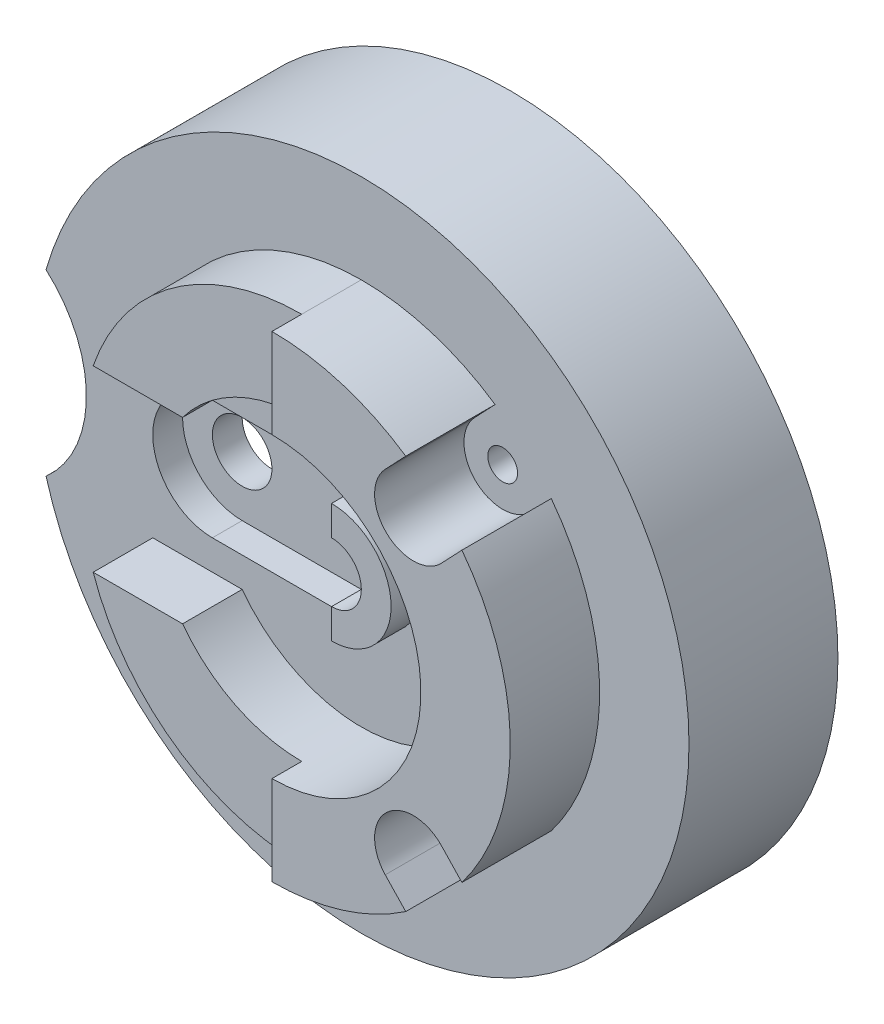
ISO-10303-21;
HEADER;
FILE_DESCRIPTION(('STEP AP214'),'2;1');
FILE_NAME('part.step','',(''),(''),'','','');
FILE_SCHEMA(('AUTOMOTIVE_DESIGN { 1 0 10303 214 1 1 1 1 }'));
ENDSEC;
DATA;
#1=APPLICATION_CONTEXT('core data for automotive mechanical design processes');
#2=APPLICATION_PROTOCOL_DEFINITION('international standard','automotive_design',2000,#1);
#3=PRODUCT_CONTEXT('',#1,'mechanical');
#4=PRODUCT('Part','Part','',(#3));
#5=PRODUCT_RELATED_PRODUCT_CATEGORY('part','',(#4));
#6=PRODUCT_DEFINITION_FORMATION('','',#4);
#7=PRODUCT_DEFINITION_CONTEXT('part definition',#1,'design');
#8=PRODUCT_DEFINITION('design','',#6,#7);
#9=PRODUCT_DEFINITION_SHAPE('','',#8);
#10=(LENGTH_UNIT() NAMED_UNIT(*) SI_UNIT(.MILLI.,.METRE.));
#11=(NAMED_UNIT(*) PLANE_ANGLE_UNIT() SI_UNIT($,.RADIAN.));
#12=(NAMED_UNIT(*) SI_UNIT($,.STERADIAN.) SOLID_ANGLE_UNIT());
#13=UNCERTAINTY_MEASURE_WITH_UNIT(LENGTH_MEASURE(1.E-05),#10,'distance_accuracy_value','');
#14=(GEOMETRIC_REPRESENTATION_CONTEXT(3) GLOBAL_UNCERTAINTY_ASSIGNED_CONTEXT((#13)) GLOBAL_UNIT_ASSIGNED_CONTEXT((#10,
#11,#12)) REPRESENTATION_CONTEXT('',''));
#15=CARTESIAN_POINT('',(0.,0.,0.));
#16=DIRECTION('',(0.,0.,1.));
#17=DIRECTION('',(1.,0.,0.));
#18=AXIS2_PLACEMENT_3D('',#15,#16,#17);
#19=CARTESIAN_POINT('',(-25.,0.,20.));
#20=DIRECTION('',(0.,0.,1.));
#21=DIRECTION('',(1.,0.,0.));
#22=AXIS2_PLACEMENT_3D('',#19,#20,#21);
#23=PLANE('',#22);
#24=CARTESIAN_POINT('',(-25.,0.,20.));
#25=DIRECTION('',(0.,0.,1.));
#26=DIRECTION('',(1.,0.,0.));
#27=AXIS2_PLACEMENT_3D('',#24,#25,#26);
#28=CIRCLE('',#27,5.);
#29=CARTESIAN_POINT('',(-20.,0.,20.));
#30=VERTEX_POINT('',#29);
#31=EDGE_CURVE('E255',#30,#30,#28,.T.);
#32=ORIENTED_EDGE('',*,*,#31,.F.);
#33=EDGE_LOOP('',(#32));
#34=FACE_BOUND('',#33,.T.);
#35=DIRECTION('',(1.,0.,0.));
#36=VECTOR('',#35,1.);
#37=CARTESIAN_POINT('',(-25.,-10.,20.));
#38=LINE('',#37,#36);
#39=CARTESIAN_POINT('',(-25.,-10.,20.));
#40=VERTEX_POINT('',#39);
#41=CARTESIAN_POINT('',(1.09408970951427E-13,-10.,20.));
#42=VERTEX_POINT('',#41);
#43=EDGE_CURVE('E264',#40,#42,#38,.T.);
#44=ORIENTED_EDGE('',*,*,#43,.T.);
#45=DIRECTION('',(0.,-1.,0.));
#46=VECTOR('',#45,1.);
#47=CARTESIAN_POINT('',(1.04744440165294E-13,-10.,20.));
#48=LINE('',#47,#46);
#49=CARTESIAN_POINT('',(0.,-4.99999999999998,20.));
#50=VERTEX_POINT('',#49);
#51=EDGE_CURVE('E823',#50,#42,#48,.T.);
#52=ORIENTED_EDGE('',*,*,#51,.F.);
#53=CARTESIAN_POINT('',(0.,0.,20.));
#54=DIRECTION('',(0.,0.,1.));
#55=DIRECTION('',(1.,0.,0.));
#56=AXIS2_PLACEMENT_3D('',#53,#54,#55);
#57=CIRCLE('',#56,5.);
#58=CARTESIAN_POINT('',(0.,5.00000000000002,20.));
#59=VERTEX_POINT('',#58);
#60=EDGE_CURVE('E245',#59,#50,#57,.T.);
#61=ORIENTED_EDGE('',*,*,#60,.F.);
#62=DIRECTION('',(0.,-1.,0.));
#63=VECTOR('',#62,1.);
#64=CARTESIAN_POINT('',(0.,5.00000000000002,20.));
#65=LINE('',#64,#63);
#66=CARTESIAN_POINT('',(0.,10.,20.));
#67=VERTEX_POINT('',#66);
#68=EDGE_CURVE('E241',#67,#59,#65,.T.);
#69=ORIENTED_EDGE('',*,*,#68,.F.);
#70=DIRECTION('',(-1.,0.,0.));
#71=VECTOR('',#70,1.);
#72=CARTESIAN_POINT('',(-25.,10.,20.));
#73=LINE('',#72,#71);
#74=CARTESIAN_POINT('',(-25.,10.,20.));
#75=VERTEX_POINT('',#74);
#76=EDGE_CURVE('E268',#67,#75,#73,.T.);
#77=ORIENTED_EDGE('',*,*,#76,.T.);
#78=CARTESIAN_POINT('',(-25.,0.,20.));
#79=DIRECTION('',(0.,0.,1.));
#80=DIRECTION('',(1.,0.,0.));
#81=AXIS2_PLACEMENT_3D('',#78,#79,#80);
#82=CIRCLE('',#81,10.);
#83=EDGE_CURVE('E261',#75,#40,#82,.T.);
#84=ORIENTED_EDGE('',*,*,#83,.T.);
#85=EDGE_LOOP('',(#44,#52,#61,#69,#77,#84));
#86=FACE_BOUND('',#85,.T.);
#87=ADVANCED_FACE('F37',(#34,#86),#23,.T.);
#88=CARTESIAN_POINT('',(0.,0.,40.));
#89=DIRECTION('',(0.,0.,-1.));
#90=DIRECTION('',(-1.,0.,0.));
#91=AXIS2_PLACEMENT_3D('',#88,#89,#90);
#92=CYLINDRICAL_SURFACE('',#91,40.);
#93=CARTESIAN_POINT('',(0.,0.,25.));
#94=DIRECTION('',(0.,0.,1.));
#95=DIRECTION('',(1.,0.,0.));
#96=AXIS2_PLACEMENT_3D('',#93,#94,#95);
#97=CIRCLE('',#96,40.);
#98=CARTESIAN_POINT('',(31.8856427380786,-24.1517243106908,25.));
#99=VERTEX_POINT('',#98);
#100=CARTESIAN_POINT('',(31.8856427380801,24.1517243106888,25.));
#101=VERTEX_POINT('',#100);
#102=EDGE_CURVE('E369',#99,#101,#97,.T.);
#103=ORIENTED_EDGE('',*,*,#102,.T.);
#104=DIRECTION('',(0.,0.,1.));
#105=VECTOR('',#104,1.);
#106=CARTESIAN_POINT('',(31.8856427380801,24.1517243106888,25.));
#107=LINE('',#106,#105);
#108=CARTESIAN_POINT('',(31.8856427380801,24.1517243106888,40.));
#109=VERTEX_POINT('',#108);
#110=EDGE_CURVE('E319',#101,#109,#107,.T.);
#111=ORIENTED_EDGE('',*,*,#110,.T.);
#112=CARTESIAN_POINT('',(0.,0.,40.));
#113=DIRECTION('',(0.,0.,1.));
#114=DIRECTION('',(1.,0.,0.));
#115=AXIS2_PLACEMENT_3D('',#112,#113,#114);
#116=CIRCLE('',#115,40.);
#117=CARTESIAN_POINT('',(31.8856427380786,-24.1517243106908,40.));
#118=VERTEX_POINT('',#117);
#119=EDGE_CURVE('E358',#118,#109,#116,.T.);
#120=ORIENTED_EDGE('',*,*,#119,.F.);
#121=DIRECTION('',(0.,0.,1.));
#122=VECTOR('',#121,1.);
#123=CARTESIAN_POINT('',(31.8856427380786,-24.1517243106908,25.));
#124=LINE('',#123,#122);
#125=EDGE_CURVE('E347',#99,#118,#124,.T.);
#126=ORIENTED_EDGE('',*,*,#125,.F.);
#127=EDGE_LOOP('',(#103,#111,#120,#126));
#128=FACE_BOUND('',#127,.T.);
#129=ADVANCED_FACE('F531',(#128),#92,.T.);
#130=CARTESIAN_POINT('',(22.4567005970187,33.1013081055094,40.));
#131=VERTEX_POINT('',#130);
#132=CARTESIAN_POINT('',(-1.29184809537196E-13,40.,40.));
#133=VERTEX_POINT('',#132);
#134=EDGE_CURVE('E359',#131,#133,#116,.T.);
#135=ORIENTED_EDGE('',*,*,#134,.F.);
#136=DIRECTION('',(0.,0.,1.));
#137=VECTOR('',#136,1.);
#138=CARTESIAN_POINT('',(22.4567005970186,33.1013081055094,25.));
#139=LINE('',#138,#137);
#140=CARTESIAN_POINT('',(22.4567005970186,33.1013081055094,25.));
#141=VERTEX_POINT('',#140);
#142=EDGE_CURVE('E311',#141,#131,#139,.T.);
#143=ORIENTED_EDGE('',*,*,#142,.F.);
#144=CARTESIAN_POINT('',(0.,40.,25.));
#145=VERTEX_POINT('',#144);
#146=EDGE_CURVE('E346',#141,#145,#97,.T.);
#147=ORIENTED_EDGE('',*,*,#146,.T.);
#148=DIRECTION('',(0.,0.,-1.));
#149=VECTOR('',#148,1.);
#150=CARTESIAN_POINT('',(0.,40.,35.));
#151=LINE('',#150,#149);
#152=CARTESIAN_POINT('',(0.,40.,35.));
#153=VERTEX_POINT('',#152);
#154=EDGE_CURVE('E419',#153,#145,#151,.T.);
#155=ORIENTED_EDGE('',*,*,#154,.F.);
#156=DIRECTION('',(0.,0.,-1.));
#157=VECTOR('',#156,1.);
#158=CARTESIAN_POINT('',(-1.29184809537196E-13,40.,40.));
#159=LINE('',#158,#157);
#160=EDGE_CURVE('E378',#133,#153,#159,.T.);
#161=ORIENTED_EDGE('',*,*,#160,.F.);
#162=EDGE_LOOP('',(#135,#143,#147,#155,#161));
#163=FACE_BOUND('',#162,.T.);
#164=ADVANCED_FACE('F496',(#163),#92,.T.);
#165=CARTESIAN_POINT('',(0.,0.,25.));
#166=DIRECTION('',(0.,0.,1.));
#167=DIRECTION('',(1.,0.,0.));
#168=AXIS2_PLACEMENT_3D('',#165,#166,#167);
#169=PLANE('',#168);
#170=CARTESIAN_POINT('',(-25.,0.,25.));
#171=DIRECTION('',(0.,0.,1.));
#172=DIRECTION('',(1.,0.,0.));
#173=AXIS2_PLACEMENT_3D('',#170,#171,#172);
#174=CIRCLE('',#173,10.);
#175=CARTESIAN_POINT('',(-25.,10.,25.));
#176=VERTEX_POINT('',#175);
#177=CARTESIAN_POINT('',(-25.,-10.,25.));
#178=VERTEX_POINT('',#177);
#179=EDGE_CURVE('E62',#176,#178,#174,.T.);
#180=ORIENTED_EDGE('',*,*,#179,.F.);
#181=DIRECTION('',(-1.,0.,0.));
#182=VECTOR('',#181,1.);
#183=CARTESIAN_POINT('',(-25.,10.,25.));
#184=LINE('',#183,#182);
#185=CARTESIAN_POINT('',(0.,10.,25.));
#186=VERTEX_POINT('',#185);
#187=EDGE_CURVE('E265',#186,#176,#184,.T.);
#188=ORIENTED_EDGE('',*,*,#187,.F.);
#189=CARTESIAN_POINT('',(0.,0.,25.));
#190=DIRECTION('',(0.,0.,1.));
#191=DIRECTION('',(1.,0.,0.));
#192=AXIS2_PLACEMENT_3D('',#189,#190,#191);
#193=CIRCLE('',#192,10.);
#194=CARTESIAN_POINT('',(1.09408970951427E-13,-10.,25.));
#195=VERTEX_POINT('',#194);
#196=EDGE_CURVE('E276',#195,#186,#193,.T.);
#197=ORIENTED_EDGE('',*,*,#196,.F.);
#198=DIRECTION('',(1.,0.,0.));
#199=VECTOR('',#198,1.);
#200=CARTESIAN_POINT('',(-25.,-10.,25.));
#201=LINE('',#200,#199);
#202=EDGE_CURVE('E273',#178,#195,#201,.T.);
#203=ORIENTED_EDGE('',*,*,#202,.F.);
#204=EDGE_LOOP('',(#180,#188,#197,#203));
#205=FACE_BOUND('',#204,.T.);
#206=CARTESIAN_POINT('',(15.,0.,25.));
#207=DIRECTION('',(0.,0.,1.));
#208=DIRECTION('',(1.,0.,0.));
#209=AXIS2_PLACEMENT_3D('',#206,#207,#208);
#210=CIRCLE('',#209,2.5);
#211=CARTESIAN_POINT('',(17.5,0.,25.));
#212=VERTEX_POINT('',#211);
#213=EDGE_CURVE('E282',#212,#212,#210,.T.);
#214=ORIENTED_EDGE('',*,*,#213,.F.);
#215=EDGE_LOOP('',(#214));
#216=FACE_BOUND('',#215,.T.);
#217=CARTESIAN_POINT('',(23.7290240541569,24.9999999999985,25.));
#218=DIRECTION('',(0.,0.,1.));
#219=DIRECTION('',(1.,0.,0.));
#220=AXIS2_PLACEMENT_3D('',#217,#218,#219);
#221=CIRCLE('',#220,2.5);
#222=CARTESIAN_POINT('',(26.2290240541569,24.9999999999985,25.));
#223=VERTEX_POINT('',#222);
#224=EDGE_CURVE('E292',#223,#223,#221,.T.);
#225=ORIENTED_EDGE('',*,*,#224,.F.);
#226=EDGE_LOOP('',(#225));
#227=FACE_BOUND('',#226,.T.);
#228=CARTESIAN_POINT('',(23.7290240541553,-25.,25.));
#229=DIRECTION('',(0.,0.,1.));
#230=DIRECTION('',(1.,0.,0.));
#231=AXIS2_PLACEMENT_3D('',#228,#229,#230);
#232=CIRCLE('',#231,2.5);
#233=CARTESIAN_POINT('',(26.2290240541553,-25.,25.));
#234=VERTEX_POINT('',#233);
#235=EDGE_CURVE('E297',#234,#234,#232,.T.);
#236=ORIENTED_EDGE('',*,*,#235,.F.);
#237=EDGE_LOOP('',(#236));
#238=FACE_BOUND('',#237,.T.);
#239=CARTESIAN_POINT('',(-66.1437827766147,0.,25.));
#240=DIRECTION('',(0.,0.,1.));
#241=DIRECTION('',(-1.,0.,0.));
#242=AXIS2_PLACEMENT_3D('',#239,#240,#241);
#243=CIRCLE('',#242,20.);
#244=CARTESIAN_POINT('',(-52.9150262212918,-15.,25.));
#245=VERTEX_POINT('',#244);
#246=CARTESIAN_POINT('',(-52.9150262212918,15.,25.));
#247=VERTEX_POINT('',#246);
#248=EDGE_CURVE('E432',#245,#247,#243,.T.);
#249=ORIENTED_EDGE('',*,*,#248,.F.);
#250=CARTESIAN_POINT('',(0.,0.,25.));
#251=DIRECTION('',(0.,0.,1.));
#252=DIRECTION('',(1.,0.,0.));
#253=AXIS2_PLACEMENT_3D('',#250,#251,#252);
#254=CIRCLE('',#253,55.);
#255=EDGE_CURVE('E458',#245,#247,#254,.T.);
#256=ORIENTED_EDGE('',*,*,#255,.T.);
#257=EDGE_LOOP('',(#249,#256));
#258=FACE_BOUND('',#257,.T.);
#259=CARTESIAN_POINT('',(0.,3.,25.));
#260=DIRECTION('',(0.,0.,1.));
#261=DIRECTION('',(-1.,0.,0.));
#262=AXIS2_PLACEMENT_3D('',#259,#260,#261);
#263=CIRCLE('',#262,37.);
#264=CARTESIAN_POINT('',(-35.,15.,25.));
#265=VERTEX_POINT('',#264);
#266=EDGE_CURVE('E408',#145,#265,#263,.T.);
#267=ORIENTED_EDGE('',*,*,#266,.F.);
#268=ORIENTED_EDGE('',*,*,#146,.F.);
#269=DIRECTION('',(-0.688429522678506,-0.725303241620113,0.));
#270=VECTOR('',#269,1.);
#271=CARTESIAN_POINT('',(22.4567005970186,33.1013081055094,25.));
#272=LINE('',#271,#270);
#273=CARTESIAN_POINT('',(19.0145529836261,29.4747918974088,25.));
#274=VERTEX_POINT('',#273);
#275=EDGE_CURVE('E301',#141,#274,#272,.T.);
#276=ORIENTED_EDGE('',*,*,#275,.T.);
#277=CARTESIAN_POINT('',(23.7290240541569,24.9999999999985,25.));
#278=DIRECTION('',(0.,0.,1.));
#279=DIRECTION('',(-1.,0.,0.));
#280=AXIS2_PLACEMENT_3D('',#277,#278,#279);
#281=CIRCLE('',#280,6.5);
#282=CARTESIAN_POINT('',(28.4434951246876,20.5252081025882,25.));
#283=VERTEX_POINT('',#282);
#284=EDGE_CURVE('E304',#274,#283,#281,.T.);
#285=ORIENTED_EDGE('',*,*,#284,.T.);
#286=DIRECTION('',(0.688429522678506,0.725303241620114,0.));
#287=VECTOR('',#286,1.);
#288=CARTESIAN_POINT('',(31.8856427380801,24.1517243106888,25.));
#289=LINE('',#288,#287);
#290=EDGE_CURVE('E308',#283,#101,#289,.T.);
#291=ORIENTED_EDGE('',*,*,#290,.T.);
#292=ORIENTED_EDGE('',*,*,#102,.F.);
#293=DIRECTION('',(-0.688429522678461,0.725303241620156,0.));
#294=VECTOR('',#293,1.);
#295=CARTESIAN_POINT('',(28.4434951246863,-20.52520810259,25.));
#296=LINE('',#295,#294);
#297=CARTESIAN_POINT('',(28.4434951246863,-20.52520810259,25.));
#298=VERTEX_POINT('',#297);
#299=EDGE_CURVE('E335',#99,#298,#296,.T.);
#300=ORIENTED_EDGE('',*,*,#299,.T.);
#301=CARTESIAN_POINT('',(23.7290240541553,-25.,25.));
#302=DIRECTION('',(0.,0.,1.));
#303=DIRECTION('',(-1.,0.,0.));
#304=AXIS2_PLACEMENT_3D('',#301,#302,#303);
#305=CIRCLE('',#304,6.5);
#306=CARTESIAN_POINT('',(19.0145529836242,-29.47479189741,25.));
#307=VERTEX_POINT('',#306);
#308=EDGE_CURVE('E328',#298,#307,#305,.T.);
#309=ORIENTED_EDGE('',*,*,#308,.T.);
#310=DIRECTION('',(0.688429522678461,-0.725303241620155,0.));
#311=VECTOR('',#310,1.);
#312=CARTESIAN_POINT('',(19.0145529836242,-29.47479189741,25.));
#313=LINE('',#312,#311);
#314=CARTESIAN_POINT('',(22.4567005970166,-33.1013081055108,25.));
#315=VERTEX_POINT('',#314);
#316=EDGE_CURVE('E331',#307,#315,#313,.T.);
#317=ORIENTED_EDGE('',*,*,#316,.T.);
#318=CARTESIAN_POINT('',(0.,-40.,25.));
#319=VERTEX_POINT('',#318);
#320=EDGE_CURVE('E366',#319,#315,#97,.T.);
#321=ORIENTED_EDGE('',*,*,#320,.F.);
#322=CARTESIAN_POINT('',(0.,-2.99999999999996,25.));
#323=DIRECTION('',(0.,0.,1.));
#324=DIRECTION('',(1.,0.,0.));
#325=AXIS2_PLACEMENT_3D('',#322,#323,#324);
#326=CIRCLE('',#325,37.);
#327=CARTESIAN_POINT('',(-35.,-15.,25.));
#328=VERTEX_POINT('',#327);
#329=EDGE_CURVE('E386',#328,#319,#326,.T.);
#330=ORIENTED_EDGE('',*,*,#329,.F.);
#331=DIRECTION('',(1.,0.,0.));
#332=VECTOR('',#331,1.);
#333=CARTESIAN_POINT('',(0.,-15.,25.));
#334=LINE('',#333,#332);
#335=CARTESIAN_POINT('',(-20.,-15.,25.));
#336=VERTEX_POINT('',#335);
#337=EDGE_CURVE('E381',#328,#336,#334,.T.);
#338=ORIENTED_EDGE('',*,*,#337,.T.);
#339=CARTESIAN_POINT('',(0.,0.,25.));
#340=DIRECTION('',(0.,0.,-1.));
#341=DIRECTION('',(-1.,0.,0.));
#342=AXIS2_PLACEMENT_3D('',#339,#340,#341);
#343=CIRCLE('',#342,25.);
#344=CARTESIAN_POINT('',(-20.,15.,25.));
#345=VERTEX_POINT('',#344);
#346=EDGE_CURVE('E413',#345,#336,#343,.T.);
#347=ORIENTED_EDGE('',*,*,#346,.F.);
#348=DIRECTION('',(1.,0.,0.));
#349=VECTOR('',#348,1.);
#350=CARTESIAN_POINT('',(-35.,15.,25.));
#351=LINE('',#350,#349);
#352=EDGE_CURVE('E422',#265,#345,#351,.T.);
#353=ORIENTED_EDGE('',*,*,#352,.F.);
#354=EDGE_LOOP('',(#267,#268,#276,#285,#291,#292,#300,#309,#317,#321,#330,#338,#347,#353));
#355=FACE_BOUND('',#354,.T.);
#356=ADVANCED_FACE('F493',(#205,#216,#227,#238,#258,#355),#169,.T.);
#357=CARTESIAN_POINT('',(0.,0.,25.));
#358=DIRECTION('',(0.,0.,-1.));
#359=DIRECTION('',(-1.,0.,0.));
#360=AXIS2_PLACEMENT_3D('',#357,#358,#359);
#361=CYLINDRICAL_SURFACE('',#360,55.);
#362=CARTESIAN_POINT('',(1.94289029309402E-13,0.,10.));
#363=DIRECTION('',(0.,0.,1.));
#364=DIRECTION('',(-1.,0.,0.));
#365=AXIS2_PLACEMENT_3D('',#362,#363,#364);
#366=CIRCLE('',#365,55.0000000000002);
#367=CARTESIAN_POINT('',(-52.9150262212918,15.,10.));
#368=VERTEX_POINT('',#367);
#369=CARTESIAN_POINT('',(-52.9150262212918,-15.,10.));
#370=VERTEX_POINT('',#369);
#371=EDGE_CURVE('E433',#368,#370,#366,.T.);
#372=ORIENTED_EDGE('',*,*,#371,.F.);
#373=DIRECTION('',(0.,0.,1.));
#374=VECTOR('',#373,1.);
#375=CARTESIAN_POINT('',(-52.9150262212918,15.,10.));
#376=LINE('',#375,#374);
#377=EDGE_CURVE('E441',#368,#247,#376,.T.);
#378=ORIENTED_EDGE('',*,*,#377,.T.);
#379=ORIENTED_EDGE('',*,*,#255,.F.);
#380=DIRECTION('',(0.,0.,1.));
#381=VECTOR('',#380,1.);
#382=CARTESIAN_POINT('',(-52.9150262212918,-15.,10.));
#383=LINE('',#382,#381);
#384=EDGE_CURVE('E439',#370,#245,#383,.T.);
#385=ORIENTED_EDGE('',*,*,#384,.F.);
#386=EDGE_LOOP('',(#372,#378,#379,#385));
#387=FACE_BOUND('',#386,.T.);
#388=CARTESIAN_POINT('',(0.,0.,0.));
#389=DIRECTION('',(0.,0.,1.));
#390=DIRECTION('',(1.,0.,0.));
#391=AXIS2_PLACEMENT_3D('',#388,#389,#390);
#392=CIRCLE('',#391,55.);
#393=CARTESIAN_POINT('',(55.,0.,0.));
#394=VERTEX_POINT('',#393);
#395=EDGE_CURVE('E455',#394,#394,#392,.T.);
#396=ORIENTED_EDGE('',*,*,#395,.T.);
#397=EDGE_LOOP('',(#396));
#398=FACE_BOUND('',#397,.T.);
#399=ADVANCED_FACE('F39',(#387,#398),#361,.T.);
#400=CARTESIAN_POINT('',(0.,0.,0.));
#401=DIRECTION('',(0.,0.,1.));
#402=DIRECTION('',(1.,0.,0.));
#403=AXIS2_PLACEMENT_3D('',#400,#401,#402);
#404=PLANE('',#403);
#405=CARTESIAN_POINT('',(0.,0.,0.));
#406=DIRECTION('',(0.,0.,-1.));
#407=DIRECTION('',(-1.,0.,0.));
#408=AXIS2_PLACEMENT_3D('',#405,#406,#407);
#409=CIRCLE('',#408,50.);
#410=CARTESIAN_POINT('',(-50.,0.,0.));
#411=VERTEX_POINT('',#410);
#412=EDGE_CURVE('E451',#411,#411,#409,.T.);
#413=ORIENTED_EDGE('',*,*,#412,.F.);
#414=EDGE_LOOP('',(#413));
#415=FACE_BOUND('',#414,.T.);
#416=ORIENTED_EDGE('',*,*,#395,.F.);
#417=EDGE_LOOP('',(#416));
#418=FACE_BOUND('',#417,.T.);
#419=ADVANCED_FACE('F641',(#415,#418),#404,.F.);
#420=CARTESIAN_POINT('',(0.,0.,15.));
#421=DIRECTION('',(0.,0.,-1.));
#422=DIRECTION('',(-1.,0.,0.));
#423=AXIS2_PLACEMENT_3D('',#420,#421,#422);
#424=CYLINDRICAL_SURFACE('',#423,50.);
#425=CARTESIAN_POINT('',(0.,0.,15.));
#426=DIRECTION('',(0.,0.,-1.));
#427=DIRECTION('',(-1.,0.,0.));
#428=AXIS2_PLACEMENT_3D('',#425,#426,#427);
#429=CIRCLE('',#428,50.);
#430=CARTESIAN_POINT('',(-48.9463992546949,10.2102889283311,15.));
#431=VERTEX_POINT('',#430);
#432=CARTESIAN_POINT('',(-48.9463992546949,-10.2102889283311,15.));
#433=VERTEX_POINT('',#432);
#434=EDGE_CURVE('E452',#431,#433,#429,.T.);
#435=ORIENTED_EDGE('',*,*,#434,.F.);
#436=DIRECTION('',(0.,0.,1.));
#437=VECTOR('',#436,1.);
#438=CARTESIAN_POINT('',(-48.9463992546949,10.2102889283311,17.5));
#439=LINE('',#438,#437);
#440=CARTESIAN_POINT('',(-48.9463992546949,10.2102889283311,10.));
#441=VERTEX_POINT('',#440);
#442=EDGE_CURVE('E448',#431,#441,#439,.F.);
#443=ORIENTED_EDGE('',*,*,#442,.T.);
#444=CARTESIAN_POINT('',(0.,0.,10.));
#445=DIRECTION('',(0.,0.,-1.));
#446=DIRECTION('',(-1.,0.,0.));
#447=AXIS2_PLACEMENT_3D('',#444,#445,#446);
#448=CIRCLE('',#447,50.);
#449=CARTESIAN_POINT('',(-48.9463992546949,-10.2102889283311,10.));
#450=VERTEX_POINT('',#449);
#451=EDGE_CURVE('E11',#441,#450,#448,.F.);
#452=ORIENTED_EDGE('',*,*,#451,.T.);
#453=DIRECTION('',(0.,0.,1.));
#454=VECTOR('',#453,1.);
#455=CARTESIAN_POINT('',(-48.9463992546949,-10.2102889283311,17.5));
#456=LINE('',#455,#454);
#457=EDGE_CURVE('E444',#450,#433,#456,.T.);
#458=ORIENTED_EDGE('',*,*,#457,.T.);
#459=EDGE_LOOP('',(#435,#443,#452,#458));
#460=FACE_BOUND('',#459,.T.);
#461=ORIENTED_EDGE('',*,*,#412,.T.);
#462=EDGE_LOOP('',(#461));
#463=FACE_BOUND('',#462,.T.);
#464=ADVANCED_FACE('F473',(#460,#463),#424,.F.);
#465=CARTESIAN_POINT('',(0.,0.,15.));
#466=DIRECTION('',(0.,0.,-1.));
#467=DIRECTION('',(-1.,0.,0.));
#468=AXIS2_PLACEMENT_3D('',#465,#466,#467);
#469=PLANE('',#468);
#470=CARTESIAN_POINT('',(0.,0.,15.));
#471=DIRECTION('',(0.,0.,-1.));
#472=DIRECTION('',(-1.,0.,0.));
#473=AXIS2_PLACEMENT_3D('',#470,#471,#472);
#474=CIRCLE('',#473,5.);
#475=CARTESIAN_POINT('',(-5.,0.,15.));
#476=VERTEX_POINT('',#475);
#477=EDGE_CURVE('E247',#476,#476,#474,.T.);
#478=ORIENTED_EDGE('',*,*,#477,.F.);
#479=EDGE_LOOP('',(#478));
#480=FACE_BOUND('',#479,.T.);
#481=CARTESIAN_POINT('',(-25.,0.,15.));
#482=DIRECTION('',(0.,0.,-1.));
#483=DIRECTION('',(-1.,0.,0.));
#484=AXIS2_PLACEMENT_3D('',#481,#482,#483);
#485=CIRCLE('',#484,5.);
#486=CARTESIAN_POINT('',(-30.,0.,15.));
#487=VERTEX_POINT('',#486);
#488=EDGE_CURVE('E258',#487,#487,#485,.T.);
#489=ORIENTED_EDGE('',*,*,#488,.F.);
#490=EDGE_LOOP('',(#489));
#491=FACE_BOUND('',#490,.T.);
#492=CARTESIAN_POINT('',(15.,0.,15.));
#493=DIRECTION('',(0.,0.,1.));
#494=DIRECTION('',(1.,0.,0.));
#495=AXIS2_PLACEMENT_3D('',#492,#493,#494);
#496=CIRCLE('',#495,2.5);
#497=CARTESIAN_POINT('',(17.5,0.,15.));
#498=VERTEX_POINT('',#497);
#499=EDGE_CURVE('E289',#498,#498,#496,.T.);
#500=ORIENTED_EDGE('',*,*,#499,.T.);
#501=EDGE_LOOP('',(#500));
#502=FACE_BOUND('',#501,.T.);
#503=CARTESIAN_POINT('',(23.7290240541569,24.9999999999985,15.));
#504=DIRECTION('',(0.,0.,-1.));
#505=DIRECTION('',(-1.,0.,0.));
#506=AXIS2_PLACEMENT_3D('',#503,#504,#505);
#507=CIRCLE('',#506,2.5);
#508=CARTESIAN_POINT('',(21.2290240541569,24.9999999999985,15.));
#509=VERTEX_POINT('',#508);
#510=EDGE_CURVE('E41',#509,#509,#507,.T.);
#511=ORIENTED_EDGE('',*,*,#510,.F.);
#512=EDGE_LOOP('',(#511));
#513=FACE_BOUND('',#512,.T.);
#514=CARTESIAN_POINT('',(23.7290240541553,-25.,15.));
#515=DIRECTION('',(0.,0.,-1.));
#516=DIRECTION('',(-1.,0.,0.));
#517=AXIS2_PLACEMENT_3D('',#514,#515,#516);
#518=CIRCLE('',#517,2.5);
#519=CARTESIAN_POINT('',(21.2290240541553,-25.,15.));
#520=VERTEX_POINT('',#519);
#521=EDGE_CURVE('E300',#520,#520,#518,.T.);
#522=ORIENTED_EDGE('',*,*,#521,.F.);
#523=EDGE_LOOP('',(#522));
#524=FACE_BOUND('',#523,.T.);
#525=CARTESIAN_POINT('',(-66.1437827766147,0.,15.));
#526=DIRECTION('',(0.,0.,-1.));
#527=DIRECTION('',(-1.,0.,0.));
#528=AXIS2_PLACEMENT_3D('',#525,#526,#527);
#529=CIRCLE('',#528,20.);
#530=EDGE_CURVE('E46',#431,#433,#529,.T.);
#531=ORIENTED_EDGE('',*,*,#530,.F.);
#532=ORIENTED_EDGE('',*,*,#434,.T.);
#533=EDGE_LOOP('',(#531,#532));
#534=FACE_BOUND('',#533,.T.);
#535=ADVANCED_FACE('F469',(#480,#491,#502,#513,#524,#534),#469,.T.);
#536=CARTESIAN_POINT('',(-33.0718913883073,0.,10.));
#537=DIRECTION('',(0.,0.,-1.));
#538=DIRECTION('',(-1.,0.,0.));
#539=AXIS2_PLACEMENT_3D('',#536,#537,#538);
#540=PLANE('',#539);
#541=CARTESIAN_POINT('',(-66.1437827766147,0.,10.));
#542=DIRECTION('',(0.,0.,1.));
#543=DIRECTION('',(-1.,0.,0.));
#544=AXIS2_PLACEMENT_3D('',#541,#542,#543);
#545=CIRCLE('',#544,20.);
#546=EDGE_CURVE('E435',#441,#368,#545,.T.);
#547=ORIENTED_EDGE('',*,*,#546,.T.);
#548=ORIENTED_EDGE('',*,*,#371,.T.);
#549=EDGE_CURVE('E436',#370,#450,#545,.T.);
#550=ORIENTED_EDGE('',*,*,#549,.T.);
#551=ORIENTED_EDGE('',*,*,#451,.F.);
#552=EDGE_LOOP('',(#547,#548,#550,#551));
#553=FACE_BOUND('',#552,.T.);
#554=ADVANCED_FACE('F472',(#553),#540,.F.);
#555=CARTESIAN_POINT('',(-66.1437827766147,0.,10.));
#556=DIRECTION('',(0.,0.,1.));
#557=DIRECTION('',(1.,0.,0.));
#558=AXIS2_PLACEMENT_3D('',#555,#556,#557);
#559=CYLINDRICAL_SURFACE('',#558,20.);
#560=ORIENTED_EDGE('',*,*,#530,.T.);
#561=ORIENTED_EDGE('',*,*,#457,.F.);
#562=ORIENTED_EDGE('',*,*,#549,.F.);
#563=ORIENTED_EDGE('',*,*,#384,.T.);
#564=ORIENTED_EDGE('',*,*,#248,.T.);
#565=ORIENTED_EDGE('',*,*,#377,.F.);
#566=ORIENTED_EDGE('',*,*,#546,.F.);
#567=ORIENTED_EDGE('',*,*,#442,.F.);
#568=EDGE_LOOP('',(#560,#561,#562,#563,#564,#565,#566,#567));
#569=FACE_BOUND('',#568,.T.);
#570=ADVANCED_FACE('F482',(#569),#559,.F.);
#571=CARTESIAN_POINT('',(0.,3.,35.));
#572=DIRECTION('',(0.,0.,-1.));
#573=DIRECTION('',(-1.,0.,0.));
#574=AXIS2_PLACEMENT_3D('',#571,#572,#573);
#575=CYLINDRICAL_SURFACE('',#574,37.);
#576=ORIENTED_EDGE('',*,*,#266,.T.);
#577=DIRECTION('',(0.,0.,-1.));
#578=VECTOR('',#577,1.);
#579=CARTESIAN_POINT('',(-35.,15.,35.));
#580=LINE('',#579,#578);
#581=CARTESIAN_POINT('',(-35.,15.,35.));
#582=VERTEX_POINT('',#581);
#583=EDGE_CURVE('E430',#582,#265,#580,.T.);
#584=ORIENTED_EDGE('',*,*,#583,.F.);
#585=CARTESIAN_POINT('',(0.,3.,35.));
#586=DIRECTION('',(0.,0.,1.));
#587=DIRECTION('',(-1.,0.,0.));
#588=AXIS2_PLACEMENT_3D('',#585,#586,#587);
#589=CIRCLE('',#588,37.);
#590=EDGE_CURVE('E409',#153,#582,#589,.T.);
#591=ORIENTED_EDGE('',*,*,#590,.F.);
#592=ORIENTED_EDGE('',*,*,#154,.T.);
#593=EDGE_LOOP('',(#576,#584,#591,#592));
#594=FACE_BOUND('',#593,.T.);
#595=ADVANCED_FACE('F505',(#594),#575,.T.);
#596=CARTESIAN_POINT('',(-35.,15.,35.));
#597=DIRECTION('',(0.,1.,0.));
#598=DIRECTION('',(0.,0.,1.));
#599=AXIS2_PLACEMENT_3D('',#596,#597,#598);
#600=PLANE('',#599);
#601=ORIENTED_EDGE('',*,*,#352,.T.);
#602=DIRECTION('',(0.,0.,-1.));
#603=VECTOR('',#602,1.);
#604=CARTESIAN_POINT('',(-20.,15.,35.));
#605=LINE('',#604,#603);
#606=CARTESIAN_POINT('',(-20.,15.,35.));
#607=VERTEX_POINT('',#606);
#608=EDGE_CURVE('E427',#607,#345,#605,.T.);
#609=ORIENTED_EDGE('',*,*,#608,.F.);
#610=DIRECTION('',(1.,0.,0.));
#611=VECTOR('',#610,1.);
#612=CARTESIAN_POINT('',(-35.,15.,35.));
#613=LINE('',#612,#611);
#614=EDGE_CURVE('E412',#582,#607,#613,.T.);
#615=ORIENTED_EDGE('',*,*,#614,.F.);
#616=ORIENTED_EDGE('',*,*,#583,.T.);
#617=EDGE_LOOP('',(#601,#609,#615,#616));
#618=FACE_BOUND('',#617,.T.);
#619=ADVANCED_FACE('F629',(#618),#600,.F.);
#620=CARTESIAN_POINT('',(0.,0.,35.));
#621=DIRECTION('',(0.,0.,-1.));
#622=DIRECTION('',(-1.,0.,0.));
#623=AXIS2_PLACEMENT_3D('',#620,#621,#622);
#624=CYLINDRICAL_SURFACE('',#623,25.);
#625=ORIENTED_EDGE('',*,*,#346,.T.);
#626=DIRECTION('',(0.,0.,-1.));
#627=VECTOR('',#626,1.);
#628=CARTESIAN_POINT('',(-20.,-15.,35.));
#629=LINE('',#628,#627);
#630=CARTESIAN_POINT('',(-20.,-15.,35.));
#631=VERTEX_POINT('',#630);
#632=EDGE_CURVE('E395',#631,#336,#629,.T.);
#633=ORIENTED_EDGE('',*,*,#632,.F.);
#634=CARTESIAN_POINT('',(0.,0.,35.));
#635=DIRECTION('',(0.,0.,1.));
#636=DIRECTION('',(1.,0.,0.));
#637=AXIS2_PLACEMENT_3D('',#634,#635,#636);
#638=CIRCLE('',#637,25.);
#639=CARTESIAN_POINT('',(0.,-25.,35.));
#640=VERTEX_POINT('',#639);
#641=EDGE_CURVE('E392',#631,#640,#638,.T.);
#642=ORIENTED_EDGE('',*,*,#641,.T.);
#643=DIRECTION('',(0.,0.,-1.));
#644=VECTOR('',#643,1.);
#645=CARTESIAN_POINT('',(0.,-25.,40.));
#646=LINE('',#645,#644);
#647=CARTESIAN_POINT('',(0.,-25.,40.));
#648=VERTEX_POINT('',#647);
#649=EDGE_CURVE('E372',#648,#640,#646,.T.);
#650=ORIENTED_EDGE('',*,*,#649,.F.);
#651=CARTESIAN_POINT('',(0.,0.,40.));
#652=DIRECTION('',(0.,0.,-1.));
#653=DIRECTION('',(1.,0.,0.));
#654=AXIS2_PLACEMENT_3D('',#651,#652,#653);
#655=CIRCLE('',#654,25.);
#656=CARTESIAN_POINT('',(0.,25.,40.));
#657=VERTEX_POINT('',#656);
#658=EDGE_CURVE('E361',#657,#648,#655,.T.);
#659=ORIENTED_EDGE('',*,*,#658,.F.);
#660=DIRECTION('',(0.,0.,-1.));
#661=VECTOR('',#660,1.);
#662=CARTESIAN_POINT('',(0.,25.,40.));
#663=LINE('',#662,#661);
#664=CARTESIAN_POINT('',(0.,25.,35.));
#665=VERTEX_POINT('',#664);
#666=EDGE_CURVE('E375',#657,#665,#663,.T.);
#667=ORIENTED_EDGE('',*,*,#666,.T.);
#668=CARTESIAN_POINT('',(0.,0.,35.));
#669=DIRECTION('',(0.,0.,-1.));
#670=DIRECTION('',(-1.,0.,0.));
#671=AXIS2_PLACEMENT_3D('',#668,#669,#670);
#672=CIRCLE('',#671,25.);
#673=EDGE_CURVE('E415',#607,#665,#672,.T.);
#674=ORIENTED_EDGE('',*,*,#673,.F.);
#675=ORIENTED_EDGE('',*,*,#608,.T.);
#676=EDGE_LOOP('',(#625,#633,#642,#650,#659,#667,#674,#675));
#677=FACE_BOUND('',#676,.T.);
#678=ADVANCED_FACE('F625',(#677),#624,.F.);
#679=CARTESIAN_POINT('',(0.,3.,35.));
#680=DIRECTION('',(0.,0.,-1.));
#681=DIRECTION('',(-1.,0.,0.));
#682=AXIS2_PLACEMENT_3D('',#679,#680,#681);
#683=PLANE('',#682);
#684=ORIENTED_EDGE('',*,*,#590,.T.);
#685=ORIENTED_EDGE('',*,*,#614,.T.);
#686=ORIENTED_EDGE('',*,*,#673,.T.);
#687=DIRECTION('',(0.,1.,0.));
#688=VECTOR('',#687,1.);
#689=CARTESIAN_POINT('',(0.,40.,35.));
#690=LINE('',#689,#688);
#691=EDGE_CURVE('E417',#665,#153,#690,.T.);
#692=ORIENTED_EDGE('',*,*,#691,.T.);
#693=EDGE_LOOP('',(#684,#685,#686,#692));
#694=FACE_BOUND('',#693,.T.);
#695=ADVANCED_FACE('F621',(#694),#683,.F.);
#696=CARTESIAN_POINT('',(0.,-15.,35.));
#697=DIRECTION('',(0.,1.,0.));
#698=DIRECTION('',(-1.,0.,0.));
#699=AXIS2_PLACEMENT_3D('',#696,#697,#698);
#700=PLANE('',#699);
#701=ORIENTED_EDGE('',*,*,#337,.F.);
#702=DIRECTION('',(0.,0.,-1.));
#703=VECTOR('',#702,1.);
#704=CARTESIAN_POINT('',(-35.,-15.,35.));
#705=LINE('',#704,#703);
#706=CARTESIAN_POINT('',(-35.,-15.,35.));
#707=VERTEX_POINT('',#706);
#708=EDGE_CURVE('E405',#707,#328,#705,.T.);
#709=ORIENTED_EDGE('',*,*,#708,.F.);
#710=DIRECTION('',(1.,0.,0.));
#711=VECTOR('',#710,1.);
#712=CARTESIAN_POINT('',(0.,-15.,35.));
#713=LINE('',#712,#711);
#714=EDGE_CURVE('E382',#707,#631,#713,.T.);
#715=ORIENTED_EDGE('',*,*,#714,.T.);
#716=ORIENTED_EDGE('',*,*,#632,.T.);
#717=EDGE_LOOP('',(#701,#709,#715,#716));
#718=FACE_BOUND('',#717,.T.);
#719=ADVANCED_FACE('F617',(#718),#700,.T.);
#720=CARTESIAN_POINT('',(0.,-2.99999999999996,35.));
#721=DIRECTION('',(0.,0.,-1.));
#722=DIRECTION('',(-1.,0.,0.));
#723=AXIS2_PLACEMENT_3D('',#720,#721,#722);
#724=CYLINDRICAL_SURFACE('',#723,37.);
#725=ORIENTED_EDGE('',*,*,#329,.T.);
#726=DIRECTION('',(0.,0.,-1.));
#727=VECTOR('',#726,1.);
#728=CARTESIAN_POINT('',(0.,-40.,35.));
#729=LINE('',#728,#727);
#730=CARTESIAN_POINT('',(0.,-40.,35.));
#731=VERTEX_POINT('',#730);
#732=EDGE_CURVE('E402',#731,#319,#729,.T.);
#733=ORIENTED_EDGE('',*,*,#732,.F.);
#734=CARTESIAN_POINT('',(0.,-2.99999999999996,35.));
#735=DIRECTION('',(0.,0.,1.));
#736=DIRECTION('',(1.,0.,0.));
#737=AXIS2_PLACEMENT_3D('',#734,#735,#736);
#738=CIRCLE('',#737,37.);
#739=EDGE_CURVE('E385',#707,#731,#738,.T.);
#740=ORIENTED_EDGE('',*,*,#739,.F.);
#741=ORIENTED_EDGE('',*,*,#708,.T.);
#742=EDGE_LOOP('',(#725,#733,#740,#741));
#743=FACE_BOUND('',#742,.T.);
#744=ADVANCED_FACE('F613',(#743),#724,.T.);
#745=CARTESIAN_POINT('',(0.,0.,35.));
#746=DIRECTION('',(0.,0.,1.));
#747=DIRECTION('',(1.,0.,0.));
#748=AXIS2_PLACEMENT_3D('',#745,#746,#747);
#749=PLANE('',#748);
#750=ORIENTED_EDGE('',*,*,#714,.F.);
#751=ORIENTED_EDGE('',*,*,#739,.T.);
#752=DIRECTION('',(0.,-1.,0.));
#753=VECTOR('',#752,1.);
#754=CARTESIAN_POINT('',(0.,0.,35.));
#755=LINE('',#754,#753);
#756=EDGE_CURVE('E389',#640,#731,#755,.T.);
#757=ORIENTED_EDGE('',*,*,#756,.F.);
#758=ORIENTED_EDGE('',*,*,#641,.F.);
#759=EDGE_LOOP('',(#750,#751,#757,#758));
#760=FACE_BOUND('',#759,.T.);
#761=ADVANCED_FACE('F607',(#760),#749,.T.);
#762=CARTESIAN_POINT('',(0.,25.,40.));
#763=DIRECTION('',(1.,0.,0.));
#764=DIRECTION('',(0.,1.,0.));
#765=AXIS2_PLACEMENT_3D('',#762,#763,#764);
#766=PLANE('',#765);
#767=ORIENTED_EDGE('',*,*,#160,.T.);
#768=ORIENTED_EDGE('',*,*,#691,.F.);
#769=ORIENTED_EDGE('',*,*,#666,.F.);
#770=DIRECTION('',(0.,-1.,0.));
#771=VECTOR('',#770,1.);
#772=CARTESIAN_POINT('',(0.,25.,40.));
#773=LINE('',#772,#771);
#774=EDGE_CURVE('E357',#133,#657,#773,.T.);
#775=ORIENTED_EDGE('',*,*,#774,.F.);
#776=EDGE_LOOP('',(#767,#768,#769,#775));
#777=FACE_BOUND('',#776,.T.);
#778=ADVANCED_FACE('F515',(#777),#766,.F.);
#779=ORIENTED_EDGE('',*,*,#320,.T.);
#780=DIRECTION('',(0.,0.,1.));
#781=VECTOR('',#780,1.);
#782=CARTESIAN_POINT('',(22.4567005970166,-33.1013081055108,25.));
#783=LINE('',#782,#781);
#784=CARTESIAN_POINT('',(22.4567005970166,-33.1013081055108,40.));
#785=VERTEX_POINT('',#784);
#786=EDGE_CURVE('E349',#315,#785,#783,.T.);
#787=ORIENTED_EDGE('',*,*,#786,.T.);
#788=CARTESIAN_POINT('',(0.,-40.,40.));
#789=VERTEX_POINT('',#788);
#790=EDGE_CURVE('E354',#789,#785,#116,.T.);
#791=ORIENTED_EDGE('',*,*,#790,.F.);
#792=DIRECTION('',(0.,0.,-1.));
#793=VECTOR('',#792,1.);
#794=CARTESIAN_POINT('',(0.,-40.,40.));
#795=LINE('',#794,#793);
#796=EDGE_CURVE('E365',#789,#731,#795,.T.);
#797=ORIENTED_EDGE('',*,*,#796,.T.);
#798=ORIENTED_EDGE('',*,*,#732,.T.);
#799=EDGE_LOOP('',(#779,#787,#791,#797,#798));
#800=FACE_BOUND('',#799,.T.);
#801=ADVANCED_FACE('F558',(#800),#92,.T.);
#802=CARTESIAN_POINT('',(0.,-40.,40.));
#803=DIRECTION('',(1.,0.,0.));
#804=DIRECTION('',(0.,1.,0.));
#805=AXIS2_PLACEMENT_3D('',#802,#803,#804);
#806=PLANE('',#805);
#807=ORIENTED_EDGE('',*,*,#756,.T.);
#808=ORIENTED_EDGE('',*,*,#796,.F.);
#809=DIRECTION('',(0.,-1.,0.));
#810=VECTOR('',#809,1.);
#811=CARTESIAN_POINT('',(0.,-40.,40.));
#812=LINE('',#811,#810);
#813=EDGE_CURVE('E363',#648,#789,#812,.T.);
#814=ORIENTED_EDGE('',*,*,#813,.F.);
#815=ORIENTED_EDGE('',*,*,#649,.T.);
#816=EDGE_LOOP('',(#807,#808,#814,#815));
#817=FACE_BOUND('',#816,.T.);
#818=ADVANCED_FACE('F602',(#817),#806,.F.);
#819=CARTESIAN_POINT('',(0.,0.,40.));
#820=DIRECTION('',(0.,0.,1.));
#821=DIRECTION('',(1.,0.,0.));
#822=AXIS2_PLACEMENT_3D('',#819,#820,#821);
#823=PLANE('',#822);
#824=DIRECTION('',(0.688429522678506,0.725303241620114,0.));
#825=VECTOR('',#824,1.);
#826=CARTESIAN_POINT('',(31.8856427380801,24.1517243106888,40.));
#827=LINE('',#826,#825);
#828=CARTESIAN_POINT('',(28.4434951246876,20.5252081025882,40.));
#829=VERTEX_POINT('',#828);
#830=EDGE_CURVE('E305',#829,#109,#827,.T.);
#831=ORIENTED_EDGE('',*,*,#830,.F.);
#832=CARTESIAN_POINT('',(23.7290240541569,24.9999999999985,40.));
#833=DIRECTION('',(0.,0.,1.));
#834=DIRECTION('',(-1.,0.,0.));
#835=AXIS2_PLACEMENT_3D('',#832,#833,#834);
#836=CIRCLE('',#835,6.5);
#837=CARTESIAN_POINT('',(19.0145529836261,29.4747918974088,40.));
#838=VERTEX_POINT('',#837);
#839=EDGE_CURVE('E315',#838,#829,#836,.T.);
#840=ORIENTED_EDGE('',*,*,#839,.F.);
#841=DIRECTION('',(-0.688429522678506,-0.725303241620113,0.));
#842=VECTOR('',#841,1.);
#843=CARTESIAN_POINT('',(22.4567005970186,33.1013081055094,40.));
#844=LINE('',#843,#842);
#845=EDGE_CURVE('E312',#131,#838,#844,.T.);
#846=ORIENTED_EDGE('',*,*,#845,.F.);
#847=ORIENTED_EDGE('',*,*,#134,.T.);
#848=ORIENTED_EDGE('',*,*,#774,.T.);
#849=ORIENTED_EDGE('',*,*,#658,.T.);
#850=ORIENTED_EDGE('',*,*,#813,.T.);
#851=ORIENTED_EDGE('',*,*,#790,.T.);
#852=DIRECTION('',(0.688429522678461,-0.725303241620155,0.));
#853=VECTOR('',#852,1.);
#854=CARTESIAN_POINT('',(19.0145529836242,-29.47479189741,40.));
#855=LINE('',#854,#853);
#856=CARTESIAN_POINT('',(19.0145529836242,-29.47479189741,40.));
#857=VERTEX_POINT('',#856);
#858=EDGE_CURVE('E340',#857,#785,#855,.T.);
#859=ORIENTED_EDGE('',*,*,#858,.F.);
#860=CARTESIAN_POINT('',(23.7290240541553,-25.,40.));
#861=DIRECTION('',(0.,0.,1.));
#862=DIRECTION('',(-1.,0.,0.));
#863=AXIS2_PLACEMENT_3D('',#860,#861,#862);
#864=CIRCLE('',#863,6.5);
#865=CARTESIAN_POINT('',(28.4434951246863,-20.52520810259,40.));
#866=VERTEX_POINT('',#865);
#867=EDGE_CURVE('E322',#866,#857,#864,.T.);
#868=ORIENTED_EDGE('',*,*,#867,.F.);
#869=DIRECTION('',(-0.688429522678461,0.725303241620156,0.));
#870=VECTOR('',#869,1.);
#871=CARTESIAN_POINT('',(28.4434951246863,-20.52520810259,40.));
#872=LINE('',#871,#870);
#873=EDGE_CURVE('E332',#118,#866,#872,.T.);
#874=ORIENTED_EDGE('',*,*,#873,.F.);
#875=ORIENTED_EDGE('',*,*,#119,.T.);
#876=EDGE_LOOP('',(#831,#840,#846,#847,#848,#849,#850,#851,#859,#868,#874,#875));
#877=FACE_BOUND('',#876,.T.);
#878=ADVANCED_FACE('F520',(#877),#823,.T.);
#879=CARTESIAN_POINT('',(23.7290240541553,-25.,25.));
#880=DIRECTION('',(0.,0.,1.));
#881=DIRECTION('',(1.,0.,0.));
#882=AXIS2_PLACEMENT_3D('',#879,#880,#881);
#883=CYLINDRICAL_SURFACE('',#882,6.5);
#884=ORIENTED_EDGE('',*,*,#867,.T.);
#885=DIRECTION('',(0.,0.,1.));
#886=VECTOR('',#885,1.);
#887=CARTESIAN_POINT('',(19.0145529836242,-29.47479189741,25.));
#888=LINE('',#887,#886);
#889=EDGE_CURVE('E338',#307,#857,#888,.T.);
#890=ORIENTED_EDGE('',*,*,#889,.F.);
#891=ORIENTED_EDGE('',*,*,#308,.F.);
#892=DIRECTION('',(0.,0.,1.));
#893=VECTOR('',#892,1.);
#894=CARTESIAN_POINT('',(28.4434951246863,-20.52520810259,25.));
#895=LINE('',#894,#893);
#896=EDGE_CURVE('E344',#298,#866,#895,.T.);
#897=ORIENTED_EDGE('',*,*,#896,.T.);
#898=EDGE_LOOP('',(#884,#890,#891,#897));
#899=FACE_BOUND('',#898,.T.);
#900=ADVANCED_FACE('F594',(#899),#883,.F.);
#901=CARTESIAN_POINT('',(28.4434951246863,-20.52520810259,25.));
#902=DIRECTION('',(0.725303241620156,0.688429522678461,0.));
#903=DIRECTION('',(-0.688429522678461,0.725303241620156,0.));
#904=AXIS2_PLACEMENT_3D('',#901,#902,#903);
#905=PLANE('',#904);
#906=ORIENTED_EDGE('',*,*,#873,.T.);
#907=ORIENTED_EDGE('',*,*,#896,.F.);
#908=ORIENTED_EDGE('',*,*,#299,.F.);
#909=ORIENTED_EDGE('',*,*,#125,.T.);
#910=EDGE_LOOP('',(#906,#907,#908,#909));
#911=FACE_BOUND('',#910,.T.);
#912=ADVANCED_FACE('F588',(#911),#905,.F.);
#913=CARTESIAN_POINT('',(19.0145529836242,-29.47479189741,25.));
#914=DIRECTION('',(-0.725303241620155,-0.688429522678461,0.));
#915=DIRECTION('',(0.688429522678461,-0.725303241620156,0.));
#916=AXIS2_PLACEMENT_3D('',#913,#914,#915);
#917=PLANE('',#916);
#918=ORIENTED_EDGE('',*,*,#858,.T.);
#919=ORIENTED_EDGE('',*,*,#786,.F.);
#920=ORIENTED_EDGE('',*,*,#316,.F.);
#921=ORIENTED_EDGE('',*,*,#889,.T.);
#922=EDGE_LOOP('',(#918,#919,#920,#921));
#923=FACE_BOUND('',#922,.T.);
#924=ADVANCED_FACE('F584',(#923),#917,.F.);
#925=CARTESIAN_POINT('',(31.8856427380801,24.1517243106888,25.));
#926=DIRECTION('',(0.725303241620114,-0.688429522678506,0.));
#927=DIRECTION('',(0.688429522678506,0.725303241620114,0.));
#928=AXIS2_PLACEMENT_3D('',#925,#926,#927);
#929=PLANE('',#928);
#930=ORIENTED_EDGE('',*,*,#830,.T.);
#931=ORIENTED_EDGE('',*,*,#110,.F.);
#932=ORIENTED_EDGE('',*,*,#290,.F.);
#933=DIRECTION('',(0.,0.,1.));
#934=VECTOR('',#933,1.);
#935=CARTESIAN_POINT('',(28.4434951246876,20.5252081025882,25.));
#936=LINE('',#935,#934);
#937=EDGE_CURVE('E323',#283,#829,#936,.T.);
#938=ORIENTED_EDGE('',*,*,#937,.T.);
#939=EDGE_LOOP('',(#930,#931,#932,#938));
#940=FACE_BOUND('',#939,.T.);
#941=ADVANCED_FACE('F535',(#940),#929,.F.);
#942=CARTESIAN_POINT('',(23.7290240541569,24.9999999999985,25.));
#943=DIRECTION('',(0.,0.,1.));
#944=DIRECTION('',(1.,0.,0.));
#945=AXIS2_PLACEMENT_3D('',#942,#943,#944);
#946=CYLINDRICAL_SURFACE('',#945,6.5);
#947=ORIENTED_EDGE('',*,*,#839,.T.);
#948=ORIENTED_EDGE('',*,*,#937,.F.);
#949=ORIENTED_EDGE('',*,*,#284,.F.);
#950=DIRECTION('',(0.,0.,1.));
#951=VECTOR('',#950,1.);
#952=CARTESIAN_POINT('',(19.0145529836261,29.4747918974088,25.));
#953=LINE('',#952,#951);
#954=EDGE_CURVE('E325',#274,#838,#953,.T.);
#955=ORIENTED_EDGE('',*,*,#954,.T.);
#956=EDGE_LOOP('',(#947,#948,#949,#955));
#957=FACE_BOUND('',#956,.T.);
#958=ADVANCED_FACE('F538',(#957),#946,.F.);
#959=CARTESIAN_POINT('',(22.4567005970186,33.1013081055094,25.));
#960=DIRECTION('',(-0.725303241620113,0.688429522678506,0.));
#961=DIRECTION('',(-0.688429522678506,-0.725303241620113,0.));
#962=AXIS2_PLACEMENT_3D('',#959,#960,#961);
#963=PLANE('',#962);
#964=ORIENTED_EDGE('',*,*,#845,.T.);
#965=ORIENTED_EDGE('',*,*,#954,.F.);
#966=ORIENTED_EDGE('',*,*,#275,.F.);
#967=ORIENTED_EDGE('',*,*,#142,.T.);
#968=EDGE_LOOP('',(#964,#965,#966,#967));
#969=FACE_BOUND('',#968,.T.);
#970=ADVANCED_FACE('F540',(#969),#963,.F.);
#971=CARTESIAN_POINT('',(23.7290240541553,-25.,0.));
#972=DIRECTION('',(0.,0.,1.));
#973=DIRECTION('',(1.,0.,0.));
#974=AXIS2_PLACEMENT_3D('',#971,#972,#973);
#975=CYLINDRICAL_SURFACE('',#974,2.5);
#976=ORIENTED_EDGE('',*,*,#521,.T.);
#977=EDGE_LOOP('',(#976));
#978=FACE_BOUND('',#977,.T.);
#979=ORIENTED_EDGE('',*,*,#235,.T.);
#980=EDGE_LOOP('',(#979));
#981=FACE_BOUND('',#980,.T.);
#982=ADVANCED_FACE('F466',(#978,#981),#975,.F.);
#983=CARTESIAN_POINT('',(23.7290240541569,24.9999999999985,0.));
#984=DIRECTION('',(0.,0.,1.));
#985=DIRECTION('',(1.,0.,0.));
#986=AXIS2_PLACEMENT_3D('',#983,#984,#985);
#987=CYLINDRICAL_SURFACE('',#986,2.5);
#988=ORIENTED_EDGE('',*,*,#510,.T.);
#989=EDGE_LOOP('',(#988));
#990=FACE_BOUND('',#989,.T.);
#991=ORIENTED_EDGE('',*,*,#224,.T.);
#992=EDGE_LOOP('',(#991));
#993=FACE_BOUND('',#992,.T.);
#994=ADVANCED_FACE('F547',(#990,#993),#987,.F.);
#995=CARTESIAN_POINT('',(15.,0.,15.));
#996=DIRECTION('',(0.,0.,1.));
#997=DIRECTION('',(1.,0.,0.));
#998=AXIS2_PLACEMENT_3D('',#995,#996,#997);
#999=CYLINDRICAL_SURFACE('',#998,2.5);
#1000=ORIENTED_EDGE('',*,*,#499,.F.);
#1001=EDGE_LOOP('',(#1000));
#1002=FACE_BOUND('',#1001,.T.);
#1003=ORIENTED_EDGE('',*,*,#213,.T.);
#1004=EDGE_LOOP('',(#1003));
#1005=FACE_BOUND('',#1004,.T.);
#1006=ADVANCED_FACE('F576',(#1002,#1005),#999,.F.);
#1007=CARTESIAN_POINT('',(-25.,0.,20.));
#1008=DIRECTION('',(0.,0.,1.));
#1009=DIRECTION('',(1.,0.,0.));
#1010=AXIS2_PLACEMENT_3D('',#1007,#1008,#1009);
#1011=CYLINDRICAL_SURFACE('',#1010,10.);
#1012=ORIENTED_EDGE('',*,*,#179,.T.);
#1013=DIRECTION('',(0.,0.,1.));
#1014=VECTOR('',#1013,1.);
#1015=CARTESIAN_POINT('',(-25.,-10.,20.));
#1016=LINE('',#1015,#1014);
#1017=EDGE_CURVE('E271',#40,#178,#1016,.T.);
#1018=ORIENTED_EDGE('',*,*,#1017,.F.);
#1019=ORIENTED_EDGE('',*,*,#83,.F.);
#1020=DIRECTION('',(0.,0.,1.));
#1021=VECTOR('',#1020,1.);
#1022=CARTESIAN_POINT('',(-25.,10.,20.));
#1023=LINE('',#1022,#1021);
#1024=EDGE_CURVE('E280',#75,#176,#1023,.T.);
#1025=ORIENTED_EDGE('',*,*,#1024,.T.);
#1026=EDGE_LOOP('',(#1012,#1018,#1019,#1025));
#1027=FACE_BOUND('',#1026,.T.);
#1028=ADVANCED_FACE('F569',(#1027),#1011,.F.);
#1029=CARTESIAN_POINT('',(-25.,10.,20.));
#1030=DIRECTION('',(0.,1.,0.));
#1031=DIRECTION('',(0.,0.,1.));
#1032=AXIS2_PLACEMENT_3D('',#1029,#1030,#1031);
#1033=PLANE('',#1032);
#1034=ORIENTED_EDGE('',*,*,#187,.T.);
#1035=ORIENTED_EDGE('',*,*,#1024,.F.);
#1036=ORIENTED_EDGE('',*,*,#76,.F.);
#1037=DIRECTION('',(0.,0.,1.));
#1038=VECTOR('',#1037,1.);
#1039=CARTESIAN_POINT('',(0.,10.,20.));
#1040=LINE('',#1039,#1038);
#1041=EDGE_CURVE('E283',#67,#186,#1040,.T.);
#1042=ORIENTED_EDGE('',*,*,#1041,.T.);
#1043=EDGE_LOOP('',(#1034,#1035,#1036,#1042));
#1044=FACE_BOUND('',#1043,.T.);
#1045=ADVANCED_FACE('F565',(#1044),#1033,.F.);
#1046=CARTESIAN_POINT('',(-25.,-10.,20.));
#1047=DIRECTION('',(0.,-1.,0.));
#1048=DIRECTION('',(0.,0.,-1.));
#1049=AXIS2_PLACEMENT_3D('',#1046,#1047,#1048);
#1050=PLANE('',#1049);
#1051=ORIENTED_EDGE('',*,*,#202,.T.);
#1052=DIRECTION('',(0.,0.,1.));
#1053=VECTOR('',#1052,1.);
#1054=CARTESIAN_POINT('',(0.,-10.,20.));
#1055=LINE('',#1054,#1053);
#1056=EDGE_CURVE('E286',#42,#195,#1055,.T.);
#1057=ORIENTED_EDGE('',*,*,#1056,.F.);
#1058=ORIENTED_EDGE('',*,*,#43,.F.);
#1059=ORIENTED_EDGE('',*,*,#1017,.T.);
#1060=EDGE_LOOP('',(#1051,#1057,#1058,#1059));
#1061=FACE_BOUND('',#1060,.T.);
#1062=ADVANCED_FACE('F568',(#1061),#1050,.F.);
#1063=CARTESIAN_POINT('',(-25.,0.,10.));
#1064=DIRECTION('',(0.,0.,1.));
#1065=DIRECTION('',(1.,0.,0.));
#1066=AXIS2_PLACEMENT_3D('',#1063,#1064,#1065);
#1067=CYLINDRICAL_SURFACE('',#1066,5.);
#1068=ORIENTED_EDGE('',*,*,#488,.T.);
#1069=EDGE_LOOP('',(#1068));
#1070=FACE_BOUND('',#1069,.T.);
#1071=ORIENTED_EDGE('',*,*,#31,.T.);
#1072=EDGE_LOOP('',(#1071));
#1073=FACE_BOUND('',#1072,.T.);
#1074=ADVANCED_FACE('F563',(#1070,#1073),#1067,.F.);
#1075=CARTESIAN_POINT('',(0.,0.,10.));
#1076=DIRECTION('',(0.,0.,1.));
#1077=DIRECTION('',(1.,0.,0.));
#1078=AXIS2_PLACEMENT_3D('',#1075,#1076,#1077);
#1079=CYLINDRICAL_SURFACE('',#1078,5.);
#1080=ORIENTED_EDGE('',*,*,#477,.T.);
#1081=EDGE_LOOP('',(#1080));
#1082=FACE_BOUND('',#1081,.T.);
#1083=ORIENTED_EDGE('',*,*,#60,.T.);
#1084=DIRECTION('',(0.,0.,-1.));
#1085=VECTOR('',#1084,1.);
#1086=CARTESIAN_POINT('',(0.,-4.99999999999998,30.));
#1087=LINE('',#1086,#1085);
#1088=CARTESIAN_POINT('',(0.,-4.99999999999998,30.));
#1089=VERTEX_POINT('',#1088);
#1090=EDGE_CURVE('E229',#1089,#50,#1087,.T.);
#1091=ORIENTED_EDGE('',*,*,#1090,.F.);
#1092=CARTESIAN_POINT('',(0.,0.,30.));
#1093=DIRECTION('',(0.,0.,-1.));
#1094=DIRECTION('',(1.,0.,0.));
#1095=AXIS2_PLACEMENT_3D('',#1092,#1093,#1094);
#1096=CIRCLE('',#1095,5.);
#1097=CARTESIAN_POINT('',(0.,5.00000000000002,30.));
#1098=VERTEX_POINT('',#1097);
#1099=EDGE_CURVE('E236',#1098,#1089,#1096,.T.);
#1100=ORIENTED_EDGE('',*,*,#1099,.F.);
#1101=DIRECTION('',(0.,0.,-1.));
#1102=VECTOR('',#1101,1.);
#1103=CARTESIAN_POINT('',(0.,5.00000000000002,30.));
#1104=LINE('',#1103,#1102);
#1105=EDGE_CURVE('E54',#1098,#59,#1104,.T.);
#1106=ORIENTED_EDGE('',*,*,#1105,.T.);
#1107=EDGE_LOOP('',(#1083,#1091,#1100,#1106));
#1108=FACE_BOUND('',#1107,.T.);
#1109=ADVANCED_FACE('F243',(#1082,#1108),#1079,.F.);
#1110=CARTESIAN_POINT('',(1.04744440165294E-13,-10.,30.));
#1111=DIRECTION('',(1.,0.,0.));
#1112=DIRECTION('',(0.,1.,0.));
#1113=AXIS2_PLACEMENT_3D('',#1110,#1111,#1112);
#1114=PLANE('',#1113);
#1115=ORIENTED_EDGE('',*,*,#51,.T.);
#1116=ORIENTED_EDGE('',*,*,#1056,.T.);
#1117=DIRECTION('',(0.,0.,-1.));
#1118=VECTOR('',#1117,1.);
#1119=CARTESIAN_POINT('',(1.09408970951427E-13,-10.,30.));
#1120=LINE('',#1119,#1118);
#1121=CARTESIAN_POINT('',(1.09408970951427E-13,-10.,30.));
#1122=VERTEX_POINT('',#1121);
#1123=EDGE_CURVE('E232',#1122,#195,#1120,.T.);
#1124=ORIENTED_EDGE('',*,*,#1123,.F.);
#1125=DIRECTION('',(0.,-1.,0.));
#1126=VECTOR('',#1125,1.);
#1127=CARTESIAN_POINT('',(1.04744440165294E-13,-10.,30.));
#1128=LINE('',#1127,#1126);
#1129=EDGE_CURVE('E225',#1089,#1122,#1128,.T.);
#1130=ORIENTED_EDGE('',*,*,#1129,.F.);
#1131=ORIENTED_EDGE('',*,*,#1090,.T.);
#1132=EDGE_LOOP('',(#1115,#1116,#1124,#1130,#1131));
#1133=FACE_BOUND('',#1132,.T.);
#1134=ADVANCED_FACE('F227',(#1133),#1114,.F.);
#1135=CARTESIAN_POINT('',(0.,0.,30.));
#1136=DIRECTION('',(0.,0.,-1.));
#1137=DIRECTION('',(-1.,0.,0.));
#1138=AXIS2_PLACEMENT_3D('',#1135,#1136,#1137);
#1139=CYLINDRICAL_SURFACE('',#1138,10.);
#1140=ORIENTED_EDGE('',*,*,#196,.T.);
#1141=DIRECTION('',(0.,0.,-1.));
#1142=VECTOR('',#1141,1.);
#1143=CARTESIAN_POINT('',(0.,10.,30.));
#1144=LINE('',#1143,#1142);
#1145=CARTESIAN_POINT('',(0.,10.,30.));
#1146=VERTEX_POINT('',#1145);
#1147=EDGE_CURVE('E249',#1146,#186,#1144,.T.);
#1148=ORIENTED_EDGE('',*,*,#1147,.F.);
#1149=CARTESIAN_POINT('',(0.,0.,30.));
#1150=DIRECTION('',(0.,0.,1.));
#1151=DIRECTION('',(-1.,0.,0.));
#1152=AXIS2_PLACEMENT_3D('',#1149,#1150,#1151);
#1153=CIRCLE('',#1152,10.);
#1154=EDGE_CURVE('E235',#1122,#1146,#1153,.T.);
#1155=ORIENTED_EDGE('',*,*,#1154,.F.);
#1156=ORIENTED_EDGE('',*,*,#1123,.T.);
#1157=EDGE_LOOP('',(#1140,#1148,#1155,#1156));
#1158=FACE_BOUND('',#1157,.T.);
#1159=ADVANCED_FACE('F789',(#1158),#1139,.T.);
#1160=CARTESIAN_POINT('',(0.,5.00000000000002,30.));
#1161=DIRECTION('',(1.,0.,0.));
#1162=DIRECTION('',(0.,0.,-1.));
#1163=AXIS2_PLACEMENT_3D('',#1160,#1161,#1162);
#1164=PLANE('',#1163);
#1165=ORIENTED_EDGE('',*,*,#68,.T.);
#1166=ORIENTED_EDGE('',*,*,#1105,.F.);
#1167=DIRECTION('',(0.,-1.,0.));
#1168=VECTOR('',#1167,1.);
#1169=CARTESIAN_POINT('',(0.,5.00000000000002,30.));
#1170=LINE('',#1169,#1168);
#1171=EDGE_CURVE('E240',#1146,#1098,#1170,.T.);
#1172=ORIENTED_EDGE('',*,*,#1171,.F.);
#1173=ORIENTED_EDGE('',*,*,#1147,.T.);
#1174=ORIENTED_EDGE('',*,*,#1041,.F.);
#1175=EDGE_LOOP('',(#1165,#1166,#1172,#1173,#1174));
#1176=FACE_BOUND('',#1175,.T.);
#1177=ADVANCED_FACE('F797',(#1176),#1164,.F.);
#1178=CARTESIAN_POINT('',(0.,0.,30.));
#1179=DIRECTION('',(0.,0.,1.));
#1180=DIRECTION('',(1.,0.,0.));
#1181=AXIS2_PLACEMENT_3D('',#1178,#1179,#1180);
#1182=PLANE('',#1181);
#1183=ORIENTED_EDGE('',*,*,#1099,.T.);
#1184=ORIENTED_EDGE('',*,*,#1129,.T.);
#1185=ORIENTED_EDGE('',*,*,#1154,.T.);
#1186=ORIENTED_EDGE('',*,*,#1171,.T.);
#1187=EDGE_LOOP('',(#1183,#1184,#1185,#1186));
#1188=FACE_BOUND('',#1187,.T.);
#1189=ADVANCED_FACE('F238',(#1188),#1182,.T.);
#1190=CLOSED_SHELL('',(#87,#129,#164,#356,#399,#419,#464,#535,#554,#570,#595,#619,#678,#695,
#719,#744,#761,#778,#801,#818,#878,#900,#912,#924,#941,#958,#970,#982,#994,#1006,#1028,#1045,
#1062,#1074,#1109,#1134,#1159,#1177,#1189));
#1191=MANIFOLD_SOLID_BREP('B2',#1190);
#1192=ADVANCED_BREP_SHAPE_REPRESENTATION('',(#18,#1191),#14);
#1193=SHAPE_DEFINITION_REPRESENTATION(#9,#1192);
ENDSEC;
END-ISO-10303-21;
